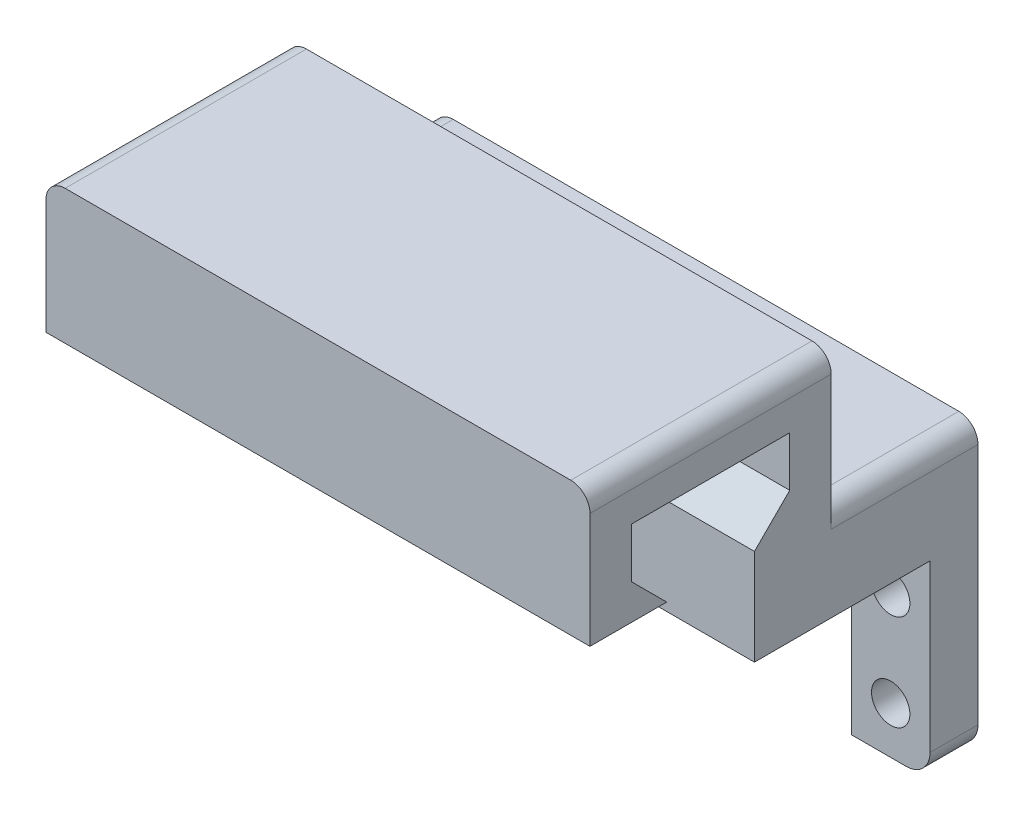
ISO-10303-21;
HEADER;
FILE_DESCRIPTION(('STEP AP214'),'2;1');
FILE_NAME('part.step','',(''),(''),'','','');
FILE_SCHEMA(('AUTOMOTIVE_DESIGN { 1 0 10303 214 1 1 1 1 }'));
ENDSEC;
DATA;
#1=APPLICATION_CONTEXT('core data for automotive mechanical design processes');
#2=APPLICATION_PROTOCOL_DEFINITION('international standard','automotive_design',2000,#1);
#3=PRODUCT_CONTEXT('',#1,'mechanical');
#4=PRODUCT('Part','Part','',(#3));
#5=PRODUCT_RELATED_PRODUCT_CATEGORY('part','',(#4));
#6=PRODUCT_DEFINITION_FORMATION('','',#4);
#7=PRODUCT_DEFINITION_CONTEXT('part definition',#1,'design');
#8=PRODUCT_DEFINITION('design','',#6,#7);
#9=PRODUCT_DEFINITION_SHAPE('','',#8);
#10=(LENGTH_UNIT() NAMED_UNIT(*) SI_UNIT(.MILLI.,.METRE.));
#11=(NAMED_UNIT(*) PLANE_ANGLE_UNIT() SI_UNIT($,.RADIAN.));
#12=(NAMED_UNIT(*) SI_UNIT($,.STERADIAN.) SOLID_ANGLE_UNIT());
#13=UNCERTAINTY_MEASURE_WITH_UNIT(LENGTH_MEASURE(1.E-05),#10,'distance_accuracy_value','');
#14=(GEOMETRIC_REPRESENTATION_CONTEXT(3) GLOBAL_UNCERTAINTY_ASSIGNED_CONTEXT((#13)) GLOBAL_UNIT_ASSIGNED_CONTEXT((#10,
#11,#12)) REPRESENTATION_CONTEXT('',''));
#15=CARTESIAN_POINT('',(0.,0.,0.));
#16=DIRECTION('',(0.,0.,1.));
#17=DIRECTION('',(1.,0.,0.));
#18=AXIS2_PLACEMENT_3D('',#15,#16,#17);
#19=CARTESIAN_POINT('',(-25.85,-7.4,5.));
#20=DIRECTION('',(0.,0.,-1.));
#21=DIRECTION('',(-1.,0.,0.));
#22=AXIS2_PLACEMENT_3D('',#19,#20,#21);
#23=CYLINDRICAL_SURFACE('',#22,2.5);
#24=CARTESIAN_POINT('',(-25.85,-7.4,0.));
#25=DIRECTION('',(0.,0.,1.));
#26=DIRECTION('',(1.,0.,0.));
#27=AXIS2_PLACEMENT_3D('',#24,#25,#26);
#28=CIRCLE('',#27,2.5);
#29=CARTESIAN_POINT('',(-25.85,-9.9,0.));
#30=VERTEX_POINT('',#29);
#31=CARTESIAN_POINT('',(-28.35,-7.39999999999998,0.));
#32=VERTEX_POINT('',#31);
#33=EDGE_CURVE('E325',#30,#32,#28,.F.);
#34=ORIENTED_EDGE('',*,*,#33,.F.);
#35=DIRECTION('',(0.,0.,-1.));
#36=VECTOR('',#35,1.);
#37=CARTESIAN_POINT('',(-25.85,-9.9,5.));
#38=LINE('',#37,#36);
#39=CARTESIAN_POINT('',(-25.85,-9.9,5.));
#40=VERTEX_POINT('',#39);
#41=EDGE_CURVE('E368',#40,#30,#38,.T.);
#42=ORIENTED_EDGE('',*,*,#41,.F.);
#43=CARTESIAN_POINT('',(-25.85,-7.4,5.));
#44=DIRECTION('',(0.,0.,1.));
#45=DIRECTION('',(1.,0.,0.));
#46=AXIS2_PLACEMENT_3D('',#43,#44,#45);
#47=CIRCLE('',#46,2.5);
#48=CARTESIAN_POINT('',(-28.35,-7.39999999999998,5.));
#49=VERTEX_POINT('',#48);
#50=EDGE_CURVE('E326',#40,#49,#47,.F.);
#51=ORIENTED_EDGE('',*,*,#50,.T.);
#52=DIRECTION('',(0.,0.,-1.));
#53=VECTOR('',#52,1.);
#54=CARTESIAN_POINT('',(-28.35,-7.39999999999998,5.));
#55=LINE('',#54,#53);
#56=EDGE_CURVE('E345',#49,#32,#55,.T.);
#57=ORIENTED_EDGE('',*,*,#56,.T.);
#58=EDGE_LOOP('',(#34,#42,#51,#57));
#59=FACE_BOUND('',#58,.T.);
#60=ADVANCED_FACE('F35',(#59),#23,.T.);
#61=CARTESIAN_POINT('',(0.,-9.9,5.));
#62=DIRECTION('',(0.,-1.,0.));
#63=DIRECTION('',(0.,0.,-1.));
#64=AXIS2_PLACEMENT_3D('',#61,#62,#63);
#65=PLANE('',#64);
#66=DIRECTION('',(-1.,0.,0.));
#67=VECTOR('',#66,1.);
#68=CARTESIAN_POINT('',(0.,-9.9,0.));
#69=LINE('',#68,#67);
#70=CARTESIAN_POINT('',(-20.15,-9.9,0.));
#71=VERTEX_POINT('',#70);
#72=EDGE_CURVE('E348',#71,#30,#69,.T.);
#73=ORIENTED_EDGE('',*,*,#72,.F.);
#74=DIRECTION('',(0.,0.,-1.));
#75=VECTOR('',#74,1.);
#76=CARTESIAN_POINT('',(-20.15,-9.9,5.));
#77=LINE('',#76,#75);
#78=CARTESIAN_POINT('',(-20.15,-9.9,5.));
#79=VERTEX_POINT('',#78);
#80=EDGE_CURVE('E366',#79,#71,#77,.T.);
#81=ORIENTED_EDGE('',*,*,#80,.F.);
#82=DIRECTION('',(-1.,0.,0.));
#83=VECTOR('',#82,1.);
#84=CARTESIAN_POINT('',(0.,-9.9,5.));
#85=LINE('',#84,#83);
#86=EDGE_CURVE('E329',#79,#40,#85,.T.);
#87=ORIENTED_EDGE('',*,*,#86,.T.);
#88=ORIENTED_EDGE('',*,*,#41,.T.);
#89=EDGE_LOOP('',(#73,#81,#87,#88));
#90=FACE_BOUND('',#89,.T.);
#91=ADVANCED_FACE('F492',(#90),#65,.T.);
#92=CARTESIAN_POINT('',(-20.15,0.,5.));
#93=DIRECTION('',(-1.,0.,0.));
#94=DIRECTION('',(0.,0.,1.));
#95=AXIS2_PLACEMENT_3D('',#92,#93,#94);
#96=PLANE('',#95);
#97=DIRECTION('',(0.,1.,0.));
#98=VECTOR('',#97,1.);
#99=CARTESIAN_POINT('',(-20.15,0.,0.));
#100=LINE('',#99,#98);
#101=CARTESIAN_POINT('',(-20.15,9.9,0.));
#102=VERTEX_POINT('',#101);
#103=EDGE_CURVE('E351',#71,#102,#100,.T.);
#104=ORIENTED_EDGE('',*,*,#103,.T.);
#105=DIRECTION('',(0.,0.,-1.));
#106=VECTOR('',#105,1.);
#107=CARTESIAN_POINT('',(-20.15,9.9,5.));
#108=LINE('',#107,#106);
#109=CARTESIAN_POINT('',(-20.15,9.9,5.));
#110=VERTEX_POINT('',#109);
#111=EDGE_CURVE('E363',#110,#102,#108,.T.);
#112=ORIENTED_EDGE('',*,*,#111,.F.);
#113=DIRECTION('',(0.,1.,0.));
#114=VECTOR('',#113,1.);
#115=CARTESIAN_POINT('',(-20.15,0.,5.));
#116=LINE('',#115,#114);
#117=EDGE_CURVE('E333',#79,#110,#116,.T.);
#118=ORIENTED_EDGE('',*,*,#117,.F.);
#119=ORIENTED_EDGE('',*,*,#80,.T.);
#120=EDGE_LOOP('',(#104,#112,#118,#119));
#121=FACE_BOUND('',#120,.T.);
#122=ADVANCED_FACE('F497',(#121),#96,.F.);
#123=CARTESIAN_POINT('',(-24.25,-5.,5.));
#124=DIRECTION('',(0.,0.,-1.));
#125=DIRECTION('',(-1.,0.,0.));
#126=AXIS2_PLACEMENT_3D('',#123,#124,#125);
#127=CYLINDRICAL_SURFACE('',#126,2.);
#128=CARTESIAN_POINT('',(-24.25,-5.,5.));
#129=DIRECTION('',(0.,0.,1.));
#130=DIRECTION('',(1.,0.,0.));
#131=AXIS2_PLACEMENT_3D('',#128,#129,#130);
#132=CIRCLE('',#131,2.);
#133=CARTESIAN_POINT('',(-22.25,-5.,5.));
#134=VERTEX_POINT('',#133);
#135=EDGE_CURVE('E339',#134,#134,#132,.T.);
#136=ORIENTED_EDGE('',*,*,#135,.T.);
#137=EDGE_LOOP('',(#136));
#138=FACE_BOUND('',#137,.T.);
#139=CARTESIAN_POINT('',(-24.25,-5.,0.));
#140=DIRECTION('',(0.,0.,1.));
#141=DIRECTION('',(1.,0.,0.));
#142=AXIS2_PLACEMENT_3D('',#139,#140,#141);
#143=CIRCLE('',#142,2.);
#144=CARTESIAN_POINT('',(-22.25,-5.,0.));
#145=VERTEX_POINT('',#144);
#146=EDGE_CURVE('E357',#145,#145,#143,.T.);
#147=ORIENTED_EDGE('',*,*,#146,.F.);
#148=EDGE_LOOP('',(#147));
#149=FACE_BOUND('',#148,.T.);
#150=ADVANCED_FACE('F603',(#138,#149),#127,.F.);
#151=CARTESIAN_POINT('',(-28.35,0.,5.));
#152=DIRECTION('',(-1.,0.,0.));
#153=DIRECTION('',(0.,0.,1.));
#154=AXIS2_PLACEMENT_3D('',#151,#152,#153);
#155=PLANE('',#154);
#156=DIRECTION('',(0.,1.,0.));
#157=VECTOR('',#156,1.);
#158=CARTESIAN_POINT('',(-28.35,19.9,15.3));
#159=LINE('',#158,#157);
#160=CARTESIAN_POINT('',(-28.35,17.9,15.3));
#161=VERTEX_POINT('',#160);
#162=CARTESIAN_POINT('',(-28.35,31.9,15.3));
#163=VERTEX_POINT('',#162);
#164=EDGE_CURVE('E238',#161,#163,#159,.T.);
#165=ORIENTED_EDGE('',*,*,#164,.F.);
#166=DIRECTION('',(0.,0.,1.));
#167=VECTOR('',#166,1.);
#168=CARTESIAN_POINT('',(-28.35,17.9,5.));
#169=LINE('',#168,#167);
#170=CARTESIAN_POINT('',(-28.35,17.9,0.));
#171=VERTEX_POINT('',#170);
#172=EDGE_CURVE('E377',#161,#171,#169,.F.);
#173=ORIENTED_EDGE('',*,*,#172,.T.);
#174=DIRECTION('',(0.,1.,0.));
#175=VECTOR('',#174,1.);
#176=CARTESIAN_POINT('',(-28.35,0.,0.));
#177=LINE('',#176,#175);
#178=EDGE_CURVE('E354',#32,#171,#177,.T.);
#179=ORIENTED_EDGE('',*,*,#178,.F.);
#180=ORIENTED_EDGE('',*,*,#56,.F.);
#181=DIRECTION('',(0.,1.,0.));
#182=VECTOR('',#181,1.);
#183=CARTESIAN_POINT('',(-28.35,0.,5.));
#184=LINE('',#183,#182);
#185=CARTESIAN_POINT('',(-28.35,9.9,5.));
#186=VERTEX_POINT('',#185);
#187=EDGE_CURVE('E337',#49,#186,#184,.T.);
#188=ORIENTED_EDGE('',*,*,#187,.T.);
#189=DIRECTION('',(0.,0.,-1.));
#190=VECTOR('',#189,1.);
#191=CARTESIAN_POINT('',(-28.35,9.9,23.3));
#192=LINE('',#191,#190);
#193=CARTESIAN_POINT('',(-28.35,9.9,23.3));
#194=VERTEX_POINT('',#193);
#195=EDGE_CURVE('E210',#194,#186,#192,.T.);
#196=ORIENTED_EDGE('',*,*,#195,.F.);
#197=DIRECTION('',(0.,1.,0.));
#198=VECTOR('',#197,1.);
#199=CARTESIAN_POINT('',(-28.35,0.,23.3));
#200=LINE('',#199,#198);
#201=CARTESIAN_POINT('',(-28.35,19.9,23.3));
#202=VERTEX_POINT('',#201);
#203=EDGE_CURVE('E202',#194,#202,#200,.T.);
#204=ORIENTED_EDGE('',*,*,#203,.T.);
#205=DIRECTION('',(0.,-0.707106781186543,0.707106781186553));
#206=VECTOR('',#205,1.);
#207=CARTESIAN_POINT('',(-28.35,19.9,23.3));
#208=LINE('',#207,#206);
#209=CARTESIAN_POINT('',(-28.35,23.57695526217,19.6230447378299));
#210=VERTEX_POINT('',#209);
#211=EDGE_CURVE('E206',#210,#202,#208,.T.);
#212=ORIENTED_EDGE('',*,*,#211,.F.);
#213=DIRECTION('',(0.,-1.,0.));
#214=VECTOR('',#213,1.);
#215=CARTESIAN_POINT('',(-28.35,23.57695526217,19.6230447378299));
#216=LINE('',#215,#214);
#217=CARTESIAN_POINT('',(-28.35,28.77695526217,19.6230447378299));
#218=VERTEX_POINT('',#217);
#219=EDGE_CURVE('E234',#218,#210,#216,.T.);
#220=ORIENTED_EDGE('',*,*,#219,.F.);
#221=DIRECTION('',(0.,0.,-1.));
#222=VECTOR('',#221,1.);
#223=CARTESIAN_POINT('',(-28.35,28.77695526217,19.6230447378299));
#224=LINE('',#223,#222);
#225=CARTESIAN_POINT('',(-28.35,28.77695526217,36.1230447378299));
#226=VERTEX_POINT('',#225);
#227=EDGE_CURVE('E242',#226,#218,#224,.T.);
#228=ORIENTED_EDGE('',*,*,#227,.F.);
#229=DIRECTION('',(0.,1.,0.));
#230=VECTOR('',#229,1.);
#231=CARTESIAN_POINT('',(-28.35,28.77695526217,36.1230447378299));
#232=LINE('',#231,#230);
#233=CARTESIAN_POINT('',(-28.35,23.5769552621701,36.1230447378299));
#234=VERTEX_POINT('',#233);
#235=EDGE_CURVE('E246',#234,#226,#232,.T.);
#236=ORIENTED_EDGE('',*,*,#235,.F.);
#237=DIRECTION('',(0.,0.707106781186555,0.70710678118654));
#238=VECTOR('',#237,1.);
#239=CARTESIAN_POINT('',(-28.35,23.5769552621701,36.1230447378299));
#240=LINE('',#239,#238);
#241=CARTESIAN_POINT('',(-28.35,19.9,32.4460894756599));
#242=VERTEX_POINT('',#241);
#243=EDGE_CURVE('E250',#242,#234,#240,.T.);
#244=ORIENTED_EDGE('',*,*,#243,.F.);
#245=DIRECTION('',(0.,0.,-1.));
#246=VECTOR('',#245,1.);
#247=CARTESIAN_POINT('',(-28.35,19.9,32.4460894756599));
#248=LINE('',#247,#246);
#249=CARTESIAN_POINT('',(-28.35,19.9,40.4460894756599));
#250=VERTEX_POINT('',#249);
#251=EDGE_CURVE('E254',#250,#242,#248,.T.);
#252=ORIENTED_EDGE('',*,*,#251,.F.);
#253=DIRECTION('',(0.,-1.,0.));
#254=VECTOR('',#253,1.);
#255=CARTESIAN_POINT('',(-28.35,19.9,40.4460894756599));
#256=LINE('',#255,#254);
#257=CARTESIAN_POINT('',(-28.35,31.9,40.4460894756599));
#258=VERTEX_POINT('',#257);
#259=EDGE_CURVE('E258',#258,#250,#256,.T.);
#260=ORIENTED_EDGE('',*,*,#259,.F.);
#261=DIRECTION('',(0.,0.,1.));
#262=VECTOR('',#261,1.);
#263=CARTESIAN_POINT('',(-28.35,31.9,5.));
#264=LINE('',#263,#262);
#265=EDGE_CURVE('E375',#258,#163,#264,.F.);
#266=ORIENTED_EDGE('',*,*,#265,.T.);
#267=EDGE_LOOP('',(#165,#173,#179,#180,#188,#196,#204,#212,#220,#228,#236,#244,#252,#260,#266));
#268=FACE_BOUND('',#267,.T.);
#269=ADVANCED_FACE('F204',(#268),#155,.T.);
#270=CARTESIAN_POINT('',(-24.25,5.,5.));
#271=DIRECTION('',(0.,0.,-1.));
#272=DIRECTION('',(-1.,0.,0.));
#273=AXIS2_PLACEMENT_3D('',#270,#271,#272);
#274=CYLINDRICAL_SURFACE('',#273,1.99999999999997);
#275=CARTESIAN_POINT('',(-24.25,5.,5.));
#276=DIRECTION('',(0.,0.,1.));
#277=DIRECTION('',(1.,0.,0.));
#278=AXIS2_PLACEMENT_3D('',#275,#276,#277);
#279=CIRCLE('',#278,1.99999999999997);
#280=CARTESIAN_POINT('',(-22.25,5.,5.));
#281=VERTEX_POINT('',#280);
#282=EDGE_CURVE('E342',#281,#281,#279,.T.);
#283=ORIENTED_EDGE('',*,*,#282,.T.);
#284=EDGE_LOOP('',(#283));
#285=FACE_BOUND('',#284,.T.);
#286=CARTESIAN_POINT('',(-24.25,5.,0.));
#287=DIRECTION('',(0.,0.,1.));
#288=DIRECTION('',(1.,0.,0.));
#289=AXIS2_PLACEMENT_3D('',#286,#287,#288);
#290=CIRCLE('',#289,1.99999999999997);
#291=CARTESIAN_POINT('',(-22.25,5.,0.));
#292=VERTEX_POINT('',#291);
#293=EDGE_CURVE('E330',#292,#292,#290,.T.);
#294=ORIENTED_EDGE('',*,*,#293,.F.);
#295=EDGE_LOOP('',(#294));
#296=FACE_BOUND('',#295,.T.);
#297=ADVANCED_FACE('F602',(#285,#296),#274,.F.);
#298=CARTESIAN_POINT('',(0.,0.,5.));
#299=DIRECTION('',(0.,0.,1.));
#300=DIRECTION('',(1.,0.,0.));
#301=AXIS2_PLACEMENT_3D('',#298,#299,#300);
#302=PLANE('',#301);
#303=ORIENTED_EDGE('',*,*,#50,.F.);
#304=ORIENTED_EDGE('',*,*,#86,.F.);
#305=ORIENTED_EDGE('',*,*,#117,.T.);
#306=DIRECTION('',(-1.,0.,0.));
#307=VECTOR('',#306,1.);
#308=CARTESIAN_POINT('',(0.,9.9,5.));
#309=LINE('',#308,#307);
#310=EDGE_CURVE('E335',#110,#186,#309,.T.);
#311=ORIENTED_EDGE('',*,*,#310,.T.);
#312=ORIENTED_EDGE('',*,*,#187,.F.);
#313=EDGE_LOOP('',(#303,#304,#305,#311,#312));
#314=FACE_BOUND('',#313,.T.);
#315=ORIENTED_EDGE('',*,*,#135,.F.);
#316=EDGE_LOOP('',(#315));
#317=FACE_BOUND('',#316,.T.);
#318=ORIENTED_EDGE('',*,*,#282,.F.);
#319=EDGE_LOOP('',(#318));
#320=FACE_BOUND('',#319,.T.);
#321=ADVANCED_FACE('F591',(#314,#317,#320),#302,.T.);
#322=CARTESIAN_POINT('',(0.,0.,0.));
#323=DIRECTION('',(0.,0.,1.));
#324=DIRECTION('',(1.,0.,0.));
#325=AXIS2_PLACEMENT_3D('',#322,#323,#324);
#326=PLANE('',#325);
#327=ORIENTED_EDGE('',*,*,#178,.T.);
#328=CARTESIAN_POINT('',(-26.35,17.9,0.));
#329=DIRECTION('',(0.,0.,1.));
#330=DIRECTION('',(1.,0.,0.));
#331=AXIS2_PLACEMENT_3D('',#328,#329,#330);
#332=CIRCLE('',#331,2.);
#333=CARTESIAN_POINT('',(-26.35,19.9,0.));
#334=VERTEX_POINT('',#333);
#335=EDGE_CURVE('E381',#171,#334,#332,.F.);
#336=ORIENTED_EDGE('',*,*,#335,.T.);
#337=DIRECTION('',(1.,0.,0.));
#338=VECTOR('',#337,1.);
#339=CARTESIAN_POINT('',(0.,19.9,0.));
#340=LINE('',#339,#338);
#341=CARTESIAN_POINT('',(26.35,19.9,0.));
#342=VERTEX_POINT('',#341);
#343=EDGE_CURVE('E311',#334,#342,#340,.T.);
#344=ORIENTED_EDGE('',*,*,#343,.T.);
#345=CARTESIAN_POINT('',(26.35,17.9,0.));
#346=DIRECTION('',(0.,0.,1.));
#347=DIRECTION('',(1.,0.,0.));
#348=AXIS2_PLACEMENT_3D('',#345,#346,#347);
#349=CIRCLE('',#348,2.);
#350=CARTESIAN_POINT('',(28.35,17.9,0.));
#351=VERTEX_POINT('',#350);
#352=EDGE_CURVE('E379',#342,#351,#349,.F.);
#353=ORIENTED_EDGE('',*,*,#352,.T.);
#354=DIRECTION('',(0.,1.,0.));
#355=VECTOR('',#354,1.);
#356=CARTESIAN_POINT('',(28.35,0.,0.));
#357=LINE('',#356,#355);
#358=CARTESIAN_POINT('',(28.35,-7.39999999999998,0.));
#359=VERTEX_POINT('',#358);
#360=EDGE_CURVE('E224',#359,#351,#357,.T.);
#361=ORIENTED_EDGE('',*,*,#360,.F.);
#362=CARTESIAN_POINT('',(25.85,-7.4,0.));
#363=DIRECTION('',(0.,0.,1.));
#364=DIRECTION('',(1.,0.,0.));
#365=AXIS2_PLACEMENT_3D('',#362,#363,#364);
#366=CIRCLE('',#365,2.5);
#367=CARTESIAN_POINT('',(25.85,-9.9,0.));
#368=VERTEX_POINT('',#367);
#369=EDGE_CURVE('E232',#359,#368,#366,.F.);
#370=ORIENTED_EDGE('',*,*,#369,.T.);
#371=DIRECTION('',(1.,0.,0.));
#372=VECTOR('',#371,1.);
#373=CARTESIAN_POINT('',(0.,-9.9,0.));
#374=LINE('',#373,#372);
#375=CARTESIAN_POINT('',(20.15,-9.9,0.));
#376=VERTEX_POINT('',#375);
#377=EDGE_CURVE('E296',#376,#368,#374,.T.);
#378=ORIENTED_EDGE('',*,*,#377,.F.);
#379=DIRECTION('',(0.,1.,0.));
#380=VECTOR('',#379,1.);
#381=CARTESIAN_POINT('',(20.15,0.,0.));
#382=LINE('',#381,#380);
#383=CARTESIAN_POINT('',(20.15,9.9,0.));
#384=VERTEX_POINT('',#383);
#385=EDGE_CURVE('E293',#376,#384,#382,.T.);
#386=ORIENTED_EDGE('',*,*,#385,.T.);
#387=DIRECTION('',(-1.,0.,0.));
#388=VECTOR('',#387,1.);
#389=CARTESIAN_POINT('',(0.,9.9,0.));
#390=LINE('',#389,#388);
#391=EDGE_CURVE('E318',#384,#102,#390,.T.);
#392=ORIENTED_EDGE('',*,*,#391,.T.);
#393=ORIENTED_EDGE('',*,*,#103,.F.);
#394=ORIENTED_EDGE('',*,*,#72,.T.);
#395=ORIENTED_EDGE('',*,*,#33,.T.);
#396=EDGE_LOOP('',(#327,#336,#344,#353,#361,#370,#378,#386,#392,#393,#394,#395));
#397=FACE_BOUND('',#396,.T.);
#398=ORIENTED_EDGE('',*,*,#146,.T.);
#399=EDGE_LOOP('',(#398));
#400=FACE_BOUND('',#399,.T.);
#401=ORIENTED_EDGE('',*,*,#293,.T.);
#402=EDGE_LOOP('',(#401));
#403=FACE_BOUND('',#402,.T.);
#404=CARTESIAN_POINT('',(24.25,5.,0.));
#405=DIRECTION('',(0.,0.,1.));
#406=DIRECTION('',(1.,0.,0.));
#407=AXIS2_PLACEMENT_3D('',#404,#405,#406);
#408=CIRCLE('',#407,1.99999999999997);
#409=CARTESIAN_POINT('',(26.25,5.,0.));
#410=VERTEX_POINT('',#409);
#411=EDGE_CURVE('E299',#410,#410,#408,.T.);
#412=ORIENTED_EDGE('',*,*,#411,.T.);
#413=EDGE_LOOP('',(#412));
#414=FACE_BOUND('',#413,.T.);
#415=CARTESIAN_POINT('',(24.25,-5.,0.));
#416=DIRECTION('',(0.,0.,1.));
#417=DIRECTION('',(1.,0.,0.));
#418=AXIS2_PLACEMENT_3D('',#415,#416,#417);
#419=CIRCLE('',#418,2.);
#420=CARTESIAN_POINT('',(26.25,-5.,0.));
#421=VERTEX_POINT('',#420);
#422=EDGE_CURVE('E274',#421,#421,#419,.T.);
#423=ORIENTED_EDGE('',*,*,#422,.T.);
#424=EDGE_LOOP('',(#423));
#425=FACE_BOUND('',#424,.T.);
#426=ADVANCED_FACE('F409',(#397,#400,#403,#414,#425),#326,.F.);
#427=CARTESIAN_POINT('',(0.,9.9,23.3));
#428=DIRECTION('',(0.,-1.,0.));
#429=DIRECTION('',(0.,0.,-1.));
#430=AXIS2_PLACEMENT_3D('',#427,#428,#429);
#431=PLANE('',#430);
#432=DIRECTION('',(0.,0.,-1.));
#433=VECTOR('',#432,1.);
#434=CARTESIAN_POINT('',(20.15,9.9,5.));
#435=LINE('',#434,#433);
#436=CARTESIAN_POINT('',(20.15,9.9,5.));
#437=VERTEX_POINT('',#436);
#438=EDGE_CURVE('E307',#437,#384,#435,.T.);
#439=ORIENTED_EDGE('',*,*,#438,.F.);
#440=DIRECTION('',(1.,0.,0.));
#441=VECTOR('',#440,1.);
#442=CARTESIAN_POINT('',(0.,9.9,5.));
#443=LINE('',#442,#441);
#444=CARTESIAN_POINT('',(28.35,9.9,5.));
#445=VERTEX_POINT('',#444);
#446=EDGE_CURVE('E276',#437,#445,#443,.T.);
#447=ORIENTED_EDGE('',*,*,#446,.T.);
#448=DIRECTION('',(0.,0.,-1.));
#449=VECTOR('',#448,1.);
#450=CARTESIAN_POINT('',(28.35,9.9,23.3));
#451=LINE('',#450,#449);
#452=CARTESIAN_POINT('',(28.35,9.9,23.3));
#453=VERTEX_POINT('',#452);
#454=EDGE_CURVE('E315',#453,#445,#451,.T.);
#455=ORIENTED_EDGE('',*,*,#454,.F.);
#456=DIRECTION('',(-1.,0.,0.));
#457=VECTOR('',#456,1.);
#458=CARTESIAN_POINT('',(0.,9.9,23.3));
#459=LINE('',#458,#457);
#460=EDGE_CURVE('E214',#453,#194,#459,.T.);
#461=ORIENTED_EDGE('',*,*,#460,.T.);
#462=ORIENTED_EDGE('',*,*,#195,.T.);
#463=ORIENTED_EDGE('',*,*,#310,.F.);
#464=ORIENTED_EDGE('',*,*,#111,.T.);
#465=ORIENTED_EDGE('',*,*,#391,.F.);
#466=EDGE_LOOP('',(#439,#447,#455,#461,#462,#463,#464,#465));
#467=FACE_BOUND('',#466,.T.);
#468=ADVANCED_FACE('F422',(#467),#431,.T.);
#469=CARTESIAN_POINT('',(0.,19.9,23.3));
#470=DIRECTION('',(0.,1.,0.));
#471=DIRECTION('',(0.,0.,1.));
#472=AXIS2_PLACEMENT_3D('',#469,#470,#471);
#473=PLANE('',#472);
#474=ORIENTED_EDGE('',*,*,#343,.F.);
#475=DIRECTION('',(0.,0.,1.));
#476=VECTOR('',#475,1.);
#477=CARTESIAN_POINT('',(-26.35,19.9,23.3));
#478=LINE('',#477,#476);
#479=CARTESIAN_POINT('',(-26.35,19.9,15.3));
#480=VERTEX_POINT('',#479);
#481=EDGE_CURVE('E372',#334,#480,#478,.T.);
#482=ORIENTED_EDGE('',*,*,#481,.T.);
#483=DIRECTION('',(1.,0.,0.));
#484=VECTOR('',#483,1.);
#485=CARTESIAN_POINT('',(-57.1306500259792,19.9,15.3));
#486=LINE('',#485,#484);
#487=CARTESIAN_POINT('',(26.35,19.9,15.3));
#488=VERTEX_POINT('',#487);
#489=EDGE_CURVE('E229',#480,#488,#486,.T.);
#490=ORIENTED_EDGE('',*,*,#489,.T.);
#491=DIRECTION('',(0.,0.,1.));
#492=VECTOR('',#491,1.);
#493=CARTESIAN_POINT('',(26.35,19.9,0.));
#494=LINE('',#493,#492);
#495=EDGE_CURVE('E370',#488,#342,#494,.F.);
#496=ORIENTED_EDGE('',*,*,#495,.T.);
#497=EDGE_LOOP('',(#474,#482,#490,#496));
#498=FACE_BOUND('',#497,.T.);
#499=ADVANCED_FACE('F568',(#498),#473,.T.);
#500=CARTESIAN_POINT('',(28.35,0.,23.3));
#501=DIRECTION('',(-1.,0.,0.));
#502=DIRECTION('',(0.,0.,1.));
#503=AXIS2_PLACEMENT_3D('',#500,#501,#502);
#504=PLANE('',#503);
#505=ORIENTED_EDGE('',*,*,#360,.T.);
#506=DIRECTION('',(0.,0.,1.));
#507=VECTOR('',#506,1.);
#508=CARTESIAN_POINT('',(28.35,17.9,15.3));
#509=LINE('',#508,#507);
#510=CARTESIAN_POINT('',(28.35,17.9,15.3));
#511=VERTEX_POINT('',#510);
#512=EDGE_CURVE('E386',#351,#511,#509,.T.);
#513=ORIENTED_EDGE('',*,*,#512,.T.);
#514=DIRECTION('',(0.,1.,0.));
#515=VECTOR('',#514,1.);
#516=CARTESIAN_POINT('',(28.35,19.9,15.3));
#517=LINE('',#516,#515);
#518=CARTESIAN_POINT('',(28.35,31.9,15.3));
#519=VERTEX_POINT('',#518);
#520=EDGE_CURVE('E446',#511,#519,#517,.T.);
#521=ORIENTED_EDGE('',*,*,#520,.T.);
#522=DIRECTION('',(0.,0.,1.));
#523=VECTOR('',#522,1.);
#524=CARTESIAN_POINT('',(28.35,31.9,40.4460894756599));
#525=LINE('',#524,#523);
#526=CARTESIAN_POINT('',(28.35,31.9,40.4460894756599));
#527=VERTEX_POINT('',#526);
#528=EDGE_CURVE('E383',#519,#527,#525,.T.);
#529=ORIENTED_EDGE('',*,*,#528,.T.);
#530=DIRECTION('',(0.,-1.,0.));
#531=VECTOR('',#530,1.);
#532=CARTESIAN_POINT('',(28.35,19.9,40.4460894756599));
#533=LINE('',#532,#531);
#534=CARTESIAN_POINT('',(28.35,19.9,40.4460894756599));
#535=VERTEX_POINT('',#534);
#536=EDGE_CURVE('E445',#527,#535,#533,.T.);
#537=ORIENTED_EDGE('',*,*,#536,.T.);
#538=DIRECTION('',(0.,0.,-1.));
#539=VECTOR('',#538,1.);
#540=CARTESIAN_POINT('',(28.35,19.9,32.4460894756599));
#541=LINE('',#540,#539);
#542=CARTESIAN_POINT('',(28.35,19.9,32.4460894756599));
#543=VERTEX_POINT('',#542);
#544=EDGE_CURVE('E442',#535,#543,#541,.T.);
#545=ORIENTED_EDGE('',*,*,#544,.T.);
#546=DIRECTION('',(0.,0.707106781186555,0.70710678118654));
#547=VECTOR('',#546,1.);
#548=CARTESIAN_POINT('',(28.35,23.5769552621701,36.1230447378299));
#549=LINE('',#548,#547);
#550=CARTESIAN_POINT('',(28.35,23.5769552621701,36.1230447378299));
#551=VERTEX_POINT('',#550);
#552=EDGE_CURVE('E439',#543,#551,#549,.T.);
#553=ORIENTED_EDGE('',*,*,#552,.T.);
#554=DIRECTION('',(0.,1.,0.));
#555=VECTOR('',#554,1.);
#556=CARTESIAN_POINT('',(28.35,28.77695526217,36.1230447378299));
#557=LINE('',#556,#555);
#558=CARTESIAN_POINT('',(28.35,28.77695526217,36.1230447378299));
#559=VERTEX_POINT('',#558);
#560=EDGE_CURVE('E436',#551,#559,#557,.T.);
#561=ORIENTED_EDGE('',*,*,#560,.T.);
#562=DIRECTION('',(0.,0.,-1.));
#563=VECTOR('',#562,1.);
#564=CARTESIAN_POINT('',(28.35,28.77695526217,19.6230447378299));
#565=LINE('',#564,#563);
#566=CARTESIAN_POINT('',(28.35,28.77695526217,19.6230447378299));
#567=VERTEX_POINT('',#566);
#568=EDGE_CURVE('E432',#559,#567,#565,.T.);
#569=ORIENTED_EDGE('',*,*,#568,.T.);
#570=DIRECTION('',(0.,-1.,0.));
#571=VECTOR('',#570,1.);
#572=CARTESIAN_POINT('',(28.35,23.57695526217,19.6230447378299));
#573=LINE('',#572,#571);
#574=CARTESIAN_POINT('',(28.35,23.57695526217,19.6230447378299));
#575=VERTEX_POINT('',#574);
#576=EDGE_CURVE('E430',#567,#575,#573,.T.);
#577=ORIENTED_EDGE('',*,*,#576,.T.);
#578=DIRECTION('',(0.,-0.707106781186543,0.707106781186553));
#579=VECTOR('',#578,1.);
#580=CARTESIAN_POINT('',(28.35,19.9,23.3));
#581=LINE('',#580,#579);
#582=CARTESIAN_POINT('',(28.35,19.9,23.3));
#583=VERTEX_POINT('',#582);
#584=EDGE_CURVE('E427',#575,#583,#581,.T.);
#585=ORIENTED_EDGE('',*,*,#584,.T.);
#586=DIRECTION('',(0.,1.,0.));
#587=VECTOR('',#586,1.);
#588=CARTESIAN_POINT('',(28.35,0.,23.3));
#589=LINE('',#588,#587);
#590=EDGE_CURVE('E220',#453,#583,#589,.T.);
#591=ORIENTED_EDGE('',*,*,#590,.F.);
#592=ORIENTED_EDGE('',*,*,#454,.T.);
#593=DIRECTION('',(0.,1.,0.));
#594=VECTOR('',#593,1.);
#595=CARTESIAN_POINT('',(28.35,0.,5.));
#596=LINE('',#595,#594);
#597=CARTESIAN_POINT('',(28.35,-7.39999999999998,5.));
#598=VERTEX_POINT('',#597);
#599=EDGE_CURVE('E273',#598,#445,#596,.T.);
#600=ORIENTED_EDGE('',*,*,#599,.F.);
#601=DIRECTION('',(0.,0.,-1.));
#602=VECTOR('',#601,1.);
#603=CARTESIAN_POINT('',(28.35,-7.39999999999998,5.));
#604=LINE('',#603,#602);
#605=EDGE_CURVE('E309',#598,#359,#604,.T.);
#606=ORIENTED_EDGE('',*,*,#605,.T.);
#607=EDGE_LOOP('',(#505,#513,#521,#529,#537,#545,#553,#561,#569,#577,#585,#591,#592,#600,#606));
#608=FACE_BOUND('',#607,.T.);
#609=ADVANCED_FACE('F425',(#608),#504,.F.);
#610=CARTESIAN_POINT('',(0.,0.,23.3));
#611=DIRECTION('',(0.,0.,1.));
#612=DIRECTION('',(1.,0.,0.));
#613=AXIS2_PLACEMENT_3D('',#610,#611,#612);
#614=PLANE('',#613);
#615=ORIENTED_EDGE('',*,*,#590,.T.);
#616=DIRECTION('',(1.,0.,0.));
#617=VECTOR('',#616,1.);
#618=CARTESIAN_POINT('',(0.,19.9,23.3));
#619=LINE('',#618,#617);
#620=EDGE_CURVE('E215',#202,#583,#619,.T.);
#621=ORIENTED_EDGE('',*,*,#620,.F.);
#622=ORIENTED_EDGE('',*,*,#203,.F.);
#623=ORIENTED_EDGE('',*,*,#460,.F.);
#624=EDGE_LOOP('',(#615,#621,#622,#623));
#625=FACE_BOUND('',#624,.T.);
#626=ADVANCED_FACE('F218',(#625),#614,.T.);
#627=CARTESIAN_POINT('',(25.85,-7.4,5.));
#628=DIRECTION('',(0.,0.,-1.));
#629=DIRECTION('',(-1.,0.,0.));
#630=AXIS2_PLACEMENT_3D('',#627,#628,#629);
#631=CYLINDRICAL_SURFACE('',#630,2.5);
#632=ORIENTED_EDGE('',*,*,#369,.F.);
#633=ORIENTED_EDGE('',*,*,#605,.F.);
#634=CARTESIAN_POINT('',(25.85,-7.4,5.));
#635=DIRECTION('',(0.,0.,1.));
#636=DIRECTION('',(1.,0.,0.));
#637=AXIS2_PLACEMENT_3D('',#634,#635,#636);
#638=CIRCLE('',#637,2.5);
#639=CARTESIAN_POINT('',(25.85,-9.9,5.));
#640=VERTEX_POINT('',#639);
#641=EDGE_CURVE('E270',#598,#640,#638,.F.);
#642=ORIENTED_EDGE('',*,*,#641,.T.);
#643=DIRECTION('',(0.,0.,-1.));
#644=VECTOR('',#643,1.);
#645=CARTESIAN_POINT('',(25.85,-9.9,5.));
#646=LINE('',#645,#644);
#647=EDGE_CURVE('E290',#640,#368,#646,.T.);
#648=ORIENTED_EDGE('',*,*,#647,.T.);
#649=EDGE_LOOP('',(#632,#633,#642,#648));
#650=FACE_BOUND('',#649,.T.);
#651=ADVANCED_FACE('F619',(#650),#631,.T.);
#652=CARTESIAN_POINT('',(20.15,0.,5.));
#653=DIRECTION('',(-1.,0.,0.));
#654=DIRECTION('',(0.,0.,1.));
#655=AXIS2_PLACEMENT_3D('',#652,#653,#654);
#656=PLANE('',#655);
#657=ORIENTED_EDGE('',*,*,#385,.F.);
#658=DIRECTION('',(0.,0.,-1.));
#659=VECTOR('',#658,1.);
#660=CARTESIAN_POINT('',(20.15,-9.9,5.));
#661=LINE('',#660,#659);
#662=CARTESIAN_POINT('',(20.15,-9.9,5.));
#663=VERTEX_POINT('',#662);
#664=EDGE_CURVE('E305',#663,#376,#661,.T.);
#665=ORIENTED_EDGE('',*,*,#664,.F.);
#666=DIRECTION('',(0.,1.,0.));
#667=VECTOR('',#666,1.);
#668=CARTESIAN_POINT('',(20.15,0.,5.));
#669=LINE('',#668,#667);
#670=EDGE_CURVE('E279',#663,#437,#669,.T.);
#671=ORIENTED_EDGE('',*,*,#670,.T.);
#672=ORIENTED_EDGE('',*,*,#438,.T.);
#673=EDGE_LOOP('',(#657,#665,#671,#672));
#674=FACE_BOUND('',#673,.T.);
#675=ADVANCED_FACE('F691',(#674),#656,.T.);
#676=CARTESIAN_POINT('',(24.25,5.,5.));
#677=DIRECTION('',(0.,0.,-1.));
#678=DIRECTION('',(-1.,0.,0.));
#679=AXIS2_PLACEMENT_3D('',#676,#677,#678);
#680=CYLINDRICAL_SURFACE('',#679,1.99999999999997);
#681=CARTESIAN_POINT('',(24.25,5.,5.));
#682=DIRECTION('',(0.,0.,1.));
#683=DIRECTION('',(1.,0.,0.));
#684=AXIS2_PLACEMENT_3D('',#681,#682,#683);
#685=CIRCLE('',#684,1.99999999999997);
#686=CARTESIAN_POINT('',(26.25,5.,5.));
#687=VERTEX_POINT('',#686);
#688=EDGE_CURVE('E284',#687,#687,#685,.T.);
#689=ORIENTED_EDGE('',*,*,#688,.T.);
#690=EDGE_LOOP('',(#689));
#691=FACE_BOUND('',#690,.T.);
#692=ORIENTED_EDGE('',*,*,#411,.F.);
#693=EDGE_LOOP('',(#692));
#694=FACE_BOUND('',#693,.T.);
#695=ADVANCED_FACE('F681',(#691,#694),#680,.F.);
#696=CARTESIAN_POINT('',(0.,-9.9,5.));
#697=DIRECTION('',(0.,1.,0.));
#698=DIRECTION('',(0.,0.,1.));
#699=AXIS2_PLACEMENT_3D('',#696,#697,#698);
#700=PLANE('',#699);
#701=ORIENTED_EDGE('',*,*,#377,.T.);
#702=ORIENTED_EDGE('',*,*,#647,.F.);
#703=DIRECTION('',(1.,0.,0.));
#704=VECTOR('',#703,1.);
#705=CARTESIAN_POINT('',(0.,-9.9,5.));
#706=LINE('',#705,#704);
#707=EDGE_CURVE('E282',#663,#640,#706,.T.);
#708=ORIENTED_EDGE('',*,*,#707,.F.);
#709=ORIENTED_EDGE('',*,*,#664,.T.);
#710=EDGE_LOOP('',(#701,#702,#708,#709));
#711=FACE_BOUND('',#710,.T.);
#712=ADVANCED_FACE('F671',(#711),#700,.F.);
#713=CARTESIAN_POINT('',(24.25,-5.,5.));
#714=DIRECTION('',(0.,0.,-1.));
#715=DIRECTION('',(-1.,0.,0.));
#716=AXIS2_PLACEMENT_3D('',#713,#714,#715);
#717=CYLINDRICAL_SURFACE('',#716,2.);
#718=CARTESIAN_POINT('',(24.25,-5.,5.));
#719=DIRECTION('',(0.,0.,1.));
#720=DIRECTION('',(1.,0.,0.));
#721=AXIS2_PLACEMENT_3D('',#718,#719,#720);
#722=CIRCLE('',#721,2.);
#723=CARTESIAN_POINT('',(26.25,-5.,5.));
#724=VERTEX_POINT('',#723);
#725=EDGE_CURVE('E287',#724,#724,#722,.T.);
#726=ORIENTED_EDGE('',*,*,#725,.T.);
#727=EDGE_LOOP('',(#726));
#728=FACE_BOUND('',#727,.T.);
#729=ORIENTED_EDGE('',*,*,#422,.F.);
#730=EDGE_LOOP('',(#729));
#731=FACE_BOUND('',#730,.T.);
#732=ADVANCED_FACE('F660',(#728,#731),#717,.F.);
#733=CARTESIAN_POINT('',(0.,0.,5.));
#734=DIRECTION('',(0.,0.,1.));
#735=DIRECTION('',(1.,0.,0.));
#736=AXIS2_PLACEMENT_3D('',#733,#734,#735);
#737=PLANE('',#736);
#738=ORIENTED_EDGE('',*,*,#641,.F.);
#739=ORIENTED_EDGE('',*,*,#599,.T.);
#740=ORIENTED_EDGE('',*,*,#446,.F.);
#741=ORIENTED_EDGE('',*,*,#670,.F.);
#742=ORIENTED_EDGE('',*,*,#707,.T.);
#743=EDGE_LOOP('',(#738,#739,#740,#741,#742));
#744=FACE_BOUND('',#743,.T.);
#745=ORIENTED_EDGE('',*,*,#688,.F.);
#746=EDGE_LOOP('',(#745));
#747=FACE_BOUND('',#746,.T.);
#748=ORIENTED_EDGE('',*,*,#725,.F.);
#749=EDGE_LOOP('',(#748));
#750=FACE_BOUND('',#749,.T.);
#751=ADVANCED_FACE('F557',(#744,#747,#750),#737,.T.);
#752=CARTESIAN_POINT('',(-57.1306500259792,19.9,15.3));
#753=DIRECTION('',(0.,0.,-1.));
#754=DIRECTION('',(0.,1.,0.));
#755=AXIS2_PLACEMENT_3D('',#752,#753,#754);
#756=PLANE('',#755);
#757=DIRECTION('',(1.,0.,0.));
#758=VECTOR('',#757,1.);
#759=CARTESIAN_POINT('',(-57.1306500259792,33.9,15.3));
#760=LINE('',#759,#758);
#761=CARTESIAN_POINT('',(-26.35,33.9,15.3));
#762=VERTEX_POINT('',#761);
#763=CARTESIAN_POINT('',(26.35,33.9,15.3));
#764=VERTEX_POINT('',#763);
#765=EDGE_CURVE('E268',#762,#764,#760,.T.);
#766=ORIENTED_EDGE('',*,*,#765,.T.);
#767=CARTESIAN_POINT('',(26.35,31.9,15.3));
#768=DIRECTION('',(0.,0.,-1.));
#769=DIRECTION('',(0.,1.,0.));
#770=AXIS2_PLACEMENT_3D('',#767,#768,#769);
#771=CIRCLE('',#770,2.);
#772=EDGE_CURVE('E398',#764,#519,#771,.T.);
#773=ORIENTED_EDGE('',*,*,#772,.T.);
#774=ORIENTED_EDGE('',*,*,#520,.F.);
#775=CARTESIAN_POINT('',(26.35,17.9,15.3));
#776=DIRECTION('',(0.,0.,-1.));
#777=DIRECTION('',(0.,1.,0.));
#778=AXIS2_PLACEMENT_3D('',#775,#776,#777);
#779=CIRCLE('',#778,2.);
#780=EDGE_CURVE('E11',#511,#488,#779,.F.);
#781=ORIENTED_EDGE('',*,*,#780,.T.);
#782=ORIENTED_EDGE('',*,*,#489,.F.);
#783=CARTESIAN_POINT('',(-26.35,17.9,15.3));
#784=DIRECTION('',(0.,0.,-1.));
#785=DIRECTION('',(0.,1.,0.));
#786=AXIS2_PLACEMENT_3D('',#783,#784,#785);
#787=CIRCLE('',#786,2.);
#788=EDGE_CURVE('E43',#480,#161,#787,.F.);
#789=ORIENTED_EDGE('',*,*,#788,.T.);
#790=ORIENTED_EDGE('',*,*,#164,.T.);
#791=CARTESIAN_POINT('',(-26.35,31.9,15.3));
#792=DIRECTION('',(0.,0.,-1.));
#793=DIRECTION('',(0.,1.,0.));
#794=AXIS2_PLACEMENT_3D('',#791,#792,#793);
#795=CIRCLE('',#794,2.);
#796=EDGE_CURVE('E57',#163,#762,#795,.T.);
#797=ORIENTED_EDGE('',*,*,#796,.T.);
#798=EDGE_LOOP('',(#766,#773,#774,#781,#782,#789,#790,#797));
#799=FACE_BOUND('',#798,.T.);
#800=ADVANCED_FACE('F402',(#799),#756,.T.);
#801=CARTESIAN_POINT('',(-57.1306500259792,33.9,40.4460894756599));
#802=DIRECTION('',(0.,1.,0.));
#803=DIRECTION('',(0.,0.,1.));
#804=AXIS2_PLACEMENT_3D('',#801,#802,#803);
#805=PLANE('',#804);
#806=DIRECTION('',(1.,0.,0.));
#807=VECTOR('',#806,1.);
#808=CARTESIAN_POINT('',(-57.1306500259792,33.9,40.4460894756599));
#809=LINE('',#808,#807);
#810=CARTESIAN_POINT('',(-26.35,33.9,40.4460894756599));
#811=VERTEX_POINT('',#810);
#812=CARTESIAN_POINT('',(26.35,33.9,40.4460894756599));
#813=VERTEX_POINT('',#812);
#814=EDGE_CURVE('E259',#811,#813,#809,.T.);
#815=ORIENTED_EDGE('',*,*,#814,.T.);
#816=DIRECTION('',(0.,0.,1.));
#817=VECTOR('',#816,1.);
#818=CARTESIAN_POINT('',(26.35,33.9,15.3));
#819=LINE('',#818,#817);
#820=EDGE_CURVE('E50',#813,#764,#819,.F.);
#821=ORIENTED_EDGE('',*,*,#820,.T.);
#822=ORIENTED_EDGE('',*,*,#765,.F.);
#823=DIRECTION('',(0.,0.,1.));
#824=VECTOR('',#823,1.);
#825=CARTESIAN_POINT('',(-26.35,33.9,40.4460894756599));
#826=LINE('',#825,#824);
#827=EDGE_CURVE('E393',#762,#811,#826,.T.);
#828=ORIENTED_EDGE('',*,*,#827,.T.);
#829=EDGE_LOOP('',(#815,#821,#822,#828));
#830=FACE_BOUND('',#829,.T.);
#831=ADVANCED_FACE('F458',(#830),#805,.T.);
#832=CARTESIAN_POINT('',(-57.1306500259792,19.9,40.4460894756599));
#833=DIRECTION('',(0.,0.,1.));
#834=DIRECTION('',(1.,0.,0.));
#835=AXIS2_PLACEMENT_3D('',#832,#833,#834);
#836=PLANE('',#835);
#837=ORIENTED_EDGE('',*,*,#536,.F.);
#838=CARTESIAN_POINT('',(26.35,31.9,40.4460894756599));
#839=DIRECTION('',(0.,0.,1.));
#840=DIRECTION('',(1.,0.,0.));
#841=AXIS2_PLACEMENT_3D('',#838,#839,#840);
#842=CIRCLE('',#841,2.);
#843=EDGE_CURVE('E391',#527,#813,#842,.T.);
#844=ORIENTED_EDGE('',*,*,#843,.T.);
#845=ORIENTED_EDGE('',*,*,#814,.F.);
#846=CARTESIAN_POINT('',(-26.35,31.9,40.4460894756599));
#847=DIRECTION('',(0.,0.,1.));
#848=DIRECTION('',(1.,0.,0.));
#849=AXIS2_PLACEMENT_3D('',#846,#847,#848);
#850=CIRCLE('',#849,2.);
#851=EDGE_CURVE('E389',#811,#258,#850,.T.);
#852=ORIENTED_EDGE('',*,*,#851,.T.);
#853=ORIENTED_EDGE('',*,*,#259,.T.);
#854=DIRECTION('',(1.,0.,0.));
#855=VECTOR('',#854,1.);
#856=CARTESIAN_POINT('',(-57.1306500259792,19.9,40.4460894756599));
#857=LINE('',#856,#855);
#858=EDGE_CURVE('E257',#250,#535,#857,.T.);
#859=ORIENTED_EDGE('',*,*,#858,.T.);
#860=EDGE_LOOP('',(#837,#844,#845,#852,#853,#859));
#861=FACE_BOUND('',#860,.T.);
#862=ADVANCED_FACE('F457',(#861),#836,.T.);
#863=CARTESIAN_POINT('',(-57.1306500259792,19.9,32.4460894756599));
#864=DIRECTION('',(0.,-1.,0.));
#865=DIRECTION('',(0.,0.,-1.));
#866=AXIS2_PLACEMENT_3D('',#863,#864,#865);
#867=PLANE('',#866);
#868=ORIENTED_EDGE('',*,*,#858,.F.);
#869=ORIENTED_EDGE('',*,*,#251,.T.);
#870=DIRECTION('',(1.,0.,0.));
#871=VECTOR('',#870,1.);
#872=CARTESIAN_POINT('',(-57.1306500259792,19.9,32.4460894756599));
#873=LINE('',#872,#871);
#874=EDGE_CURVE('E253',#242,#543,#873,.T.);
#875=ORIENTED_EDGE('',*,*,#874,.T.);
#876=ORIENTED_EDGE('',*,*,#544,.F.);
#877=EDGE_LOOP('',(#868,#869,#875,#876));
#878=FACE_BOUND('',#877,.T.);
#879=ADVANCED_FACE('F468',(#878),#867,.T.);
#880=CARTESIAN_POINT('',(-57.1306500259792,23.5769552621701,36.1230447378299));
#881=DIRECTION('',(0.,0.70710678118654,-0.707106781186555));
#882=DIRECTION('',(0.,0.707106781186555,0.70710678118654));
#883=AXIS2_PLACEMENT_3D('',#880,#881,#882);
#884=PLANE('',#883);
#885=ORIENTED_EDGE('',*,*,#874,.F.);
#886=ORIENTED_EDGE('',*,*,#243,.T.);
#887=DIRECTION('',(1.,0.,0.));
#888=VECTOR('',#887,1.);
#889=CARTESIAN_POINT('',(-57.1306500259792,23.5769552621701,36.1230447378299));
#890=LINE('',#889,#888);
#891=EDGE_CURVE('E249',#234,#551,#890,.T.);
#892=ORIENTED_EDGE('',*,*,#891,.T.);
#893=ORIENTED_EDGE('',*,*,#552,.F.);
#894=EDGE_LOOP('',(#885,#886,#892,#893));
#895=FACE_BOUND('',#894,.T.);
#896=ADVANCED_FACE('F472',(#895),#884,.T.);
#897=CARTESIAN_POINT('',(-57.1306500259792,28.77695526217,36.1230447378299));
#898=DIRECTION('',(0.,0.,-1.));
#899=DIRECTION('',(0.,1.,0.));
#900=AXIS2_PLACEMENT_3D('',#897,#898,#899);
#901=PLANE('',#900);
#902=ORIENTED_EDGE('',*,*,#891,.F.);
#903=ORIENTED_EDGE('',*,*,#235,.T.);
#904=DIRECTION('',(1.,0.,0.));
#905=VECTOR('',#904,1.);
#906=CARTESIAN_POINT('',(-57.1306500259792,28.77695526217,36.1230447378299));
#907=LINE('',#906,#905);
#908=EDGE_CURVE('E245',#226,#559,#907,.T.);
#909=ORIENTED_EDGE('',*,*,#908,.T.);
#910=ORIENTED_EDGE('',*,*,#560,.F.);
#911=EDGE_LOOP('',(#902,#903,#909,#910));
#912=FACE_BOUND('',#911,.T.);
#913=ADVANCED_FACE('F475',(#912),#901,.T.);
#914=CARTESIAN_POINT('',(-57.1306500259792,28.77695526217,19.6230447378299));
#915=DIRECTION('',(0.,-1.,0.));
#916=DIRECTION('',(0.,0.,-1.));
#917=AXIS2_PLACEMENT_3D('',#914,#915,#916);
#918=PLANE('',#917);
#919=ORIENTED_EDGE('',*,*,#908,.F.);
#920=ORIENTED_EDGE('',*,*,#227,.T.);
#921=DIRECTION('',(1.,0.,0.));
#922=VECTOR('',#921,1.);
#923=CARTESIAN_POINT('',(-57.1306500259792,28.77695526217,19.6230447378299));
#924=LINE('',#923,#922);
#925=EDGE_CURVE('E241',#218,#567,#924,.T.);
#926=ORIENTED_EDGE('',*,*,#925,.T.);
#927=ORIENTED_EDGE('',*,*,#568,.F.);
#928=EDGE_LOOP('',(#919,#920,#926,#927));
#929=FACE_BOUND('',#928,.T.);
#930=ADVANCED_FACE('F479',(#929),#918,.T.);
#931=CARTESIAN_POINT('',(-57.1306500259792,23.57695526217,19.6230447378299));
#932=DIRECTION('',(0.,0.,1.));
#933=DIRECTION('',(1.,0.,0.));
#934=AXIS2_PLACEMENT_3D('',#931,#932,#933);
#935=PLANE('',#934);
#936=ORIENTED_EDGE('',*,*,#925,.F.);
#937=ORIENTED_EDGE('',*,*,#219,.T.);
#938=DIRECTION('',(1.,0.,0.));
#939=VECTOR('',#938,1.);
#940=CARTESIAN_POINT('',(-57.1306500259792,23.57695526217,19.6230447378299));
#941=LINE('',#940,#939);
#942=EDGE_CURVE('E227',#210,#575,#941,.T.);
#943=ORIENTED_EDGE('',*,*,#942,.T.);
#944=ORIENTED_EDGE('',*,*,#576,.F.);
#945=EDGE_LOOP('',(#936,#937,#943,#944));
#946=FACE_BOUND('',#945,.T.);
#947=ADVANCED_FACE('F482',(#946),#935,.T.);
#948=CARTESIAN_POINT('',(-57.1306500259792,19.9,23.3));
#949=DIRECTION('',(0.,0.707106781186552,0.707106781186542));
#950=DIRECTION('',(0.,-0.707106781186543,0.707106781186553));
#951=AXIS2_PLACEMENT_3D('',#948,#949,#950);
#952=PLANE('',#951);
#953=ORIENTED_EDGE('',*,*,#942,.F.);
#954=ORIENTED_EDGE('',*,*,#211,.T.);
#955=ORIENTED_EDGE('',*,*,#620,.T.);
#956=ORIENTED_EDGE('',*,*,#584,.F.);
#957=EDGE_LOOP('',(#953,#954,#955,#956));
#958=FACE_BOUND('',#957,.T.);
#959=ADVANCED_FACE('F226',(#958),#952,.T.);
#960=CARTESIAN_POINT('',(-26.35,17.9,23.3));
#961=DIRECTION('',(0.,0.,1.));
#962=DIRECTION('',(1.,0.,0.));
#963=AXIS2_PLACEMENT_3D('',#960,#961,#962);
#964=CYLINDRICAL_SURFACE('',#963,2.);
#965=ORIENTED_EDGE('',*,*,#335,.F.);
#966=ORIENTED_EDGE('',*,*,#172,.F.);
#967=ORIENTED_EDGE('',*,*,#788,.F.);
#968=ORIENTED_EDGE('',*,*,#481,.F.);
#969=EDGE_LOOP('',(#965,#966,#967,#968));
#970=FACE_BOUND('',#969,.T.);
#971=ADVANCED_FACE('F406',(#970),#964,.T.);
#972=CARTESIAN_POINT('',(26.35,17.9,23.3));
#973=DIRECTION('',(0.,0.,-1.));
#974=DIRECTION('',(-1.,0.,0.));
#975=AXIS2_PLACEMENT_3D('',#972,#973,#974);
#976=CYLINDRICAL_SURFACE('',#975,2.);
#977=ORIENTED_EDGE('',*,*,#352,.F.);
#978=ORIENTED_EDGE('',*,*,#495,.F.);
#979=ORIENTED_EDGE('',*,*,#780,.F.);
#980=ORIENTED_EDGE('',*,*,#512,.F.);
#981=EDGE_LOOP('',(#977,#978,#979,#980));
#982=FACE_BOUND('',#981,.T.);
#983=ADVANCED_FACE('F504',(#982),#976,.T.);
#984=CARTESIAN_POINT('',(26.35,31.9,23.3));
#985=DIRECTION('',(0.,0.,-1.));
#986=DIRECTION('',(-1.,0.,0.));
#987=AXIS2_PLACEMENT_3D('',#984,#985,#986);
#988=CYLINDRICAL_SURFACE('',#987,2.);
#989=ORIENTED_EDGE('',*,*,#772,.F.);
#990=ORIENTED_EDGE('',*,*,#820,.F.);
#991=ORIENTED_EDGE('',*,*,#843,.F.);
#992=ORIENTED_EDGE('',*,*,#528,.F.);
#993=EDGE_LOOP('',(#989,#990,#991,#992));
#994=FACE_BOUND('',#993,.T.);
#995=ADVANCED_FACE('F454',(#994),#988,.T.);
#996=CARTESIAN_POINT('',(-26.35,31.9,40.4460894756599));
#997=DIRECTION('',(0.,0.,1.));
#998=DIRECTION('',(1.,0.,0.));
#999=AXIS2_PLACEMENT_3D('',#996,#997,#998);
#1000=CYLINDRICAL_SURFACE('',#999,2.);
#1001=ORIENTED_EDGE('',*,*,#796,.F.);
#1002=ORIENTED_EDGE('',*,*,#265,.F.);
#1003=ORIENTED_EDGE('',*,*,#851,.F.);
#1004=ORIENTED_EDGE('',*,*,#827,.F.);
#1005=EDGE_LOOP('',(#1001,#1002,#1003,#1004));
#1006=FACE_BOUND('',#1005,.T.);
#1007=ADVANCED_FACE('F37',(#1006),#1000,.T.);
#1008=CLOSED_SHELL('',(#60,#91,#122,#150,#269,#297,#321,#426,#468,#499,#609,#626,#651,#675,#695,
#712,#732,#751,#800,#831,#862,#879,#896,#913,#930,#947,#959,#971,#983,#995,#1007));
#1009=MANIFOLD_SOLID_BREP('B2',#1008);
#1010=ADVANCED_BREP_SHAPE_REPRESENTATION('',(#18,#1009),#14);
#1011=SHAPE_DEFINITION_REPRESENTATION(#9,#1010);
ENDSEC;
END-ISO-10303-21;
